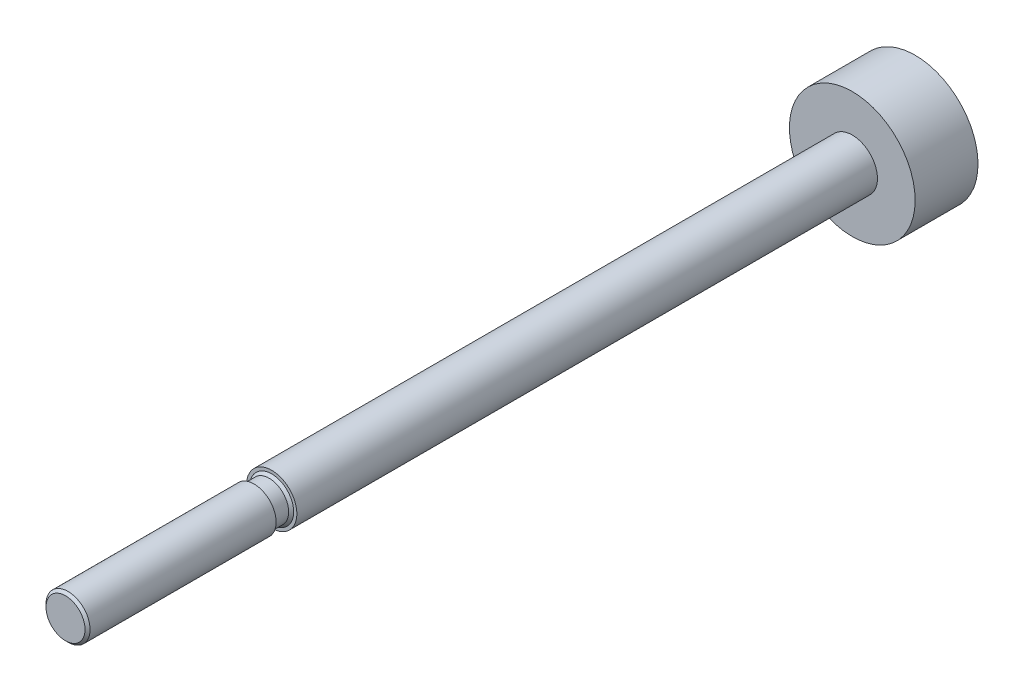
ISO-10303-21;
HEADER;
FILE_DESCRIPTION(('STEP AP214'),'2;1');
FILE_NAME('part.step','',(''),(''),'','','');
FILE_SCHEMA(('AUTOMOTIVE_DESIGN { 1 0 10303 214 1 1 1 1 }'));
ENDSEC;
DATA;
#1=APPLICATION_CONTEXT('core data for automotive mechanical design processes');
#2=APPLICATION_PROTOCOL_DEFINITION('international standard','automotive_design',2000,#1);
#3=PRODUCT_CONTEXT('',#1,'mechanical');
#4=PRODUCT('Part','Part','',(#3));
#5=PRODUCT_RELATED_PRODUCT_CATEGORY('part','',(#4));
#6=PRODUCT_DEFINITION_FORMATION('','',#4);
#7=PRODUCT_DEFINITION_CONTEXT('part definition',#1,'design');
#8=PRODUCT_DEFINITION('design','',#6,#7);
#9=PRODUCT_DEFINITION_SHAPE('','',#8);
#10=(LENGTH_UNIT() NAMED_UNIT(*) SI_UNIT(.MILLI.,.METRE.));
#11=(NAMED_UNIT(*) PLANE_ANGLE_UNIT() SI_UNIT($,.RADIAN.));
#12=(NAMED_UNIT(*) SI_UNIT($,.STERADIAN.) SOLID_ANGLE_UNIT());
#13=UNCERTAINTY_MEASURE_WITH_UNIT(LENGTH_MEASURE(1.E-05),#10,'distance_accuracy_value','');
#14=(GEOMETRIC_REPRESENTATION_CONTEXT(3) GLOBAL_UNCERTAINTY_ASSIGNED_CONTEXT((#13)) GLOBAL_UNIT_ASSIGNED_CONTEXT((#10,
#11,#12)) REPRESENTATION_CONTEXT('',''));
#15=CARTESIAN_POINT('',(0.,0.,0.));
#16=DIRECTION('',(0.,0.,1.));
#17=DIRECTION('',(1.,0.,0.));
#18=AXIS2_PLACEMENT_3D('',#15,#16,#17);
#19=CARTESIAN_POINT('',(0.,0.,2.5));
#20=DIRECTION('',(0.,0.,1.));
#21=DIRECTION('',(1.,0.,0.));
#22=AXIS2_PLACEMENT_3D('',#19,#20,#21);
#23=PLANE('',#22);
#24=CARTESIAN_POINT('',(0.,0.,2.5));
#25=DIRECTION('',(0.,0.,1.));
#26=DIRECTION('',(1.,0.,0.));
#27=AXIS2_PLACEMENT_3D('',#24,#25,#26);
#28=CIRCLE('',#27,5.);
#29=CARTESIAN_POINT('',(5.,0.,2.5));
#30=VERTEX_POINT('',#29);
#31=EDGE_CURVE('E40',#30,#30,#28,.T.);
#32=ORIENTED_EDGE('',*,*,#31,.T.);
#33=EDGE_LOOP('',(#32));
#34=FACE_BOUND('',#33,.T.);
#35=CARTESIAN_POINT('',(0.,0.,2.5));
#36=DIRECTION('',(0.,0.,1.));
#37=DIRECTION('',(1.,0.,0.));
#38=AXIS2_PLACEMENT_3D('',#35,#36,#37);
#39=CIRCLE('',#38,2.);
#40=CARTESIAN_POINT('',(2.,0.,2.5));
#41=VERTEX_POINT('',#40);
#42=EDGE_CURVE('E10',#41,#41,#39,.T.);
#43=ORIENTED_EDGE('',*,*,#42,.F.);
#44=EDGE_LOOP('',(#43));
#45=FACE_BOUND('',#44,.T.);
#46=ADVANCED_FACE('F32',(#34,#45),#23,.T.);
#47=CARTESIAN_POINT('',(0.,0.,2.5));
#48=DIRECTION('',(0.,0.,-1.));
#49=DIRECTION('',(-1.,0.,0.));
#50=AXIS2_PLACEMENT_3D('',#47,#48,#49);
#51=CYLINDRICAL_SURFACE('',#50,5.);
#52=ORIENTED_EDGE('',*,*,#31,.F.);
#53=EDGE_LOOP('',(#52));
#54=FACE_BOUND('',#53,.T.);
#55=CARTESIAN_POINT('',(0.,0.,-2.5));
#56=DIRECTION('',(0.,0.,1.));
#57=DIRECTION('',(1.,0.,0.));
#58=AXIS2_PLACEMENT_3D('',#55,#56,#57);
#59=CIRCLE('',#58,5.);
#60=CARTESIAN_POINT('',(5.,0.,-2.5));
#61=VERTEX_POINT('',#60);
#62=EDGE_CURVE('E44',#61,#61,#59,.T.);
#63=ORIENTED_EDGE('',*,*,#62,.T.);
#64=EDGE_LOOP('',(#63));
#65=FACE_BOUND('',#64,.T.);
#66=ADVANCED_FACE('F107',(#54,#65),#51,.T.);
#67=CARTESIAN_POINT('',(0.,0.,-2.5));
#68=DIRECTION('',(0.,0.,1.));
#69=DIRECTION('',(1.,0.,0.));
#70=AXIS2_PLACEMENT_3D('',#67,#68,#69);
#71=PLANE('',#70);
#72=ORIENTED_EDGE('',*,*,#62,.F.);
#73=EDGE_LOOP('',(#72));
#74=FACE_BOUND('',#73,.T.);
#75=ADVANCED_FACE('F113',(#74),#71,.F.);
#76=CARTESIAN_POINT('',(0.,0.,70.7418542494924));
#77=DIRECTION('',(0.,0.,-1.));
#78=DIRECTION('',(-1.,0.,0.));
#79=AXIS2_PLACEMENT_3D('',#76,#77,#78);
#80=CYLINDRICAL_SURFACE('',#79,2.);
#81=CARTESIAN_POINT('',(0.,0.,48.685));
#82=DIRECTION('',(0.,0.,-1.));
#83=DIRECTION('',(-1.,0.,0.));
#84=AXIS2_PLACEMENT_3D('',#81,#82,#83);
#85=CIRCLE('',#84,2.);
#86=CARTESIAN_POINT('',(-2.,0.,48.685));
#87=VERTEX_POINT('',#86);
#88=EDGE_CURVE('E36',#87,#87,#85,.T.);
#89=ORIENTED_EDGE('',*,*,#88,.T.);
#90=EDGE_LOOP('',(#89));
#91=FACE_BOUND('',#90,.T.);
#92=ORIENTED_EDGE('',*,*,#42,.T.);
#93=EDGE_LOOP('',(#92));
#94=FACE_BOUND('',#93,.T.);
#95=ADVANCED_FACE('F34',(#91,#94),#80,.T.);
#96=CARTESIAN_POINT('',(0.,1.75,48.685));
#97=DIRECTION('',(0.,0.,-1.));
#98=DIRECTION('',(-1.,0.,0.));
#99=AXIS2_PLACEMENT_3D('',#96,#97,#98);
#100=PLANE('',#99);
#101=CARTESIAN_POINT('',(0.,0.,48.685));
#102=DIRECTION('',(0.,0.,-1.));
#103=DIRECTION('',(-1.,0.,0.));
#104=AXIS2_PLACEMENT_3D('',#101,#102,#103);
#105=CIRCLE('',#104,1.75);
#106=CARTESIAN_POINT('',(-1.75,0.,48.685));
#107=VERTEX_POINT('',#106);
#108=EDGE_CURVE('E64',#107,#107,#105,.T.);
#109=ORIENTED_EDGE('',*,*,#108,.T.);
#110=EDGE_LOOP('',(#109));
#111=FACE_BOUND('',#110,.T.);
#112=ORIENTED_EDGE('',*,*,#88,.F.);
#113=EDGE_LOOP('',(#112));
#114=FACE_BOUND('',#113,.T.);
#115=ADVANCED_FACE('F68',(#111,#114),#100,.F.);
#116=CARTESIAN_POINT('',(0.,0.,65.085));
#117=DIRECTION('',(0.,0.,-1.));
#118=DIRECTION('',(-1.,0.,0.));
#119=AXIS2_PLACEMENT_3D('',#116,#117,#118);
#120=CONICAL_SURFACE('',#119,1.55249999999998,0.78539816339745);
#121=CARTESIAN_POINT('',(0.,0.,64.885));
#122=DIRECTION('',(0.,0.,-1.));
#123=DIRECTION('',(-1.,0.,0.));
#124=AXIS2_PLACEMENT_3D('',#121,#122,#123);
#125=CIRCLE('',#124,1.75249999999999);
#126=CARTESIAN_POINT('',(-1.75249999999999,0.,64.885));
#127=VERTEX_POINT('',#126);
#128=EDGE_CURVE('E52',#127,#127,#125,.T.);
#129=ORIENTED_EDGE('',*,*,#128,.F.);
#130=EDGE_LOOP('',(#129));
#131=FACE_BOUND('',#130,.T.);
#132=CARTESIAN_POINT('',(0.,0.,65.085));
#133=DIRECTION('',(0.,0.,-1.));
#134=DIRECTION('',(-1.,0.,0.));
#135=AXIS2_PLACEMENT_3D('',#132,#133,#134);
#136=CIRCLE('',#135,1.55249999999998);
#137=CARTESIAN_POINT('',(-1.55249999999998,0.,65.085));
#138=VERTEX_POINT('',#137);
#139=EDGE_CURVE('E49',#138,#138,#136,.T.);
#140=ORIENTED_EDGE('',*,*,#139,.T.);
#141=EDGE_LOOP('',(#140));
#142=FACE_BOUND('',#141,.T.);
#143=ADVANCED_FACE('F93',(#131,#142),#120,.T.);
#144=CARTESIAN_POINT('',(0.,0.,0.));
#145=DIRECTION('',(0.,0.,-1.));
#146=DIRECTION('',(-1.,0.,0.));
#147=AXIS2_PLACEMENT_3D('',#144,#145,#146);
#148=CYLINDRICAL_SURFACE('',#147,1.75249999999999);
#149=CARTESIAN_POINT('',(0.,0.,50.085));
#150=DIRECTION('',(0.,0.,-1.));
#151=DIRECTION('',(-1.,0.,0.));
#152=AXIS2_PLACEMENT_3D('',#149,#150,#151);
#153=CIRCLE('',#152,1.75249999999999);
#154=CARTESIAN_POINT('',(-1.75249999999999,0.,50.085));
#155=VERTEX_POINT('',#154);
#156=EDGE_CURVE('E55',#155,#155,#153,.T.);
#157=ORIENTED_EDGE('',*,*,#156,.F.);
#158=EDGE_LOOP('',(#157));
#159=FACE_BOUND('',#158,.T.);
#160=ORIENTED_EDGE('',*,*,#128,.T.);
#161=EDGE_LOOP('',(#160));
#162=FACE_BOUND('',#161,.T.);
#163=ADVANCED_FACE('F87',(#159,#162),#148,.T.);
#164=CARTESIAN_POINT('',(0.,1.75249999999999,50.085));
#165=DIRECTION('',(0.,0.,1.));
#166=DIRECTION('',(1.,0.,0.));
#167=AXIS2_PLACEMENT_3D('',#164,#165,#166);
#168=PLANE('',#167);
#169=CARTESIAN_POINT('',(0.,0.,50.085));
#170=DIRECTION('',(0.,0.,-1.));
#171=DIRECTION('',(-1.,0.,0.));
#172=AXIS2_PLACEMENT_3D('',#169,#170,#171);
#173=CIRCLE('',#172,1.54999999999999);
#174=CARTESIAN_POINT('',(-1.54999999999999,0.,50.085));
#175=VERTEX_POINT('',#174);
#176=EDGE_CURVE('E58',#175,#175,#173,.T.);
#177=ORIENTED_EDGE('',*,*,#176,.F.);
#178=EDGE_LOOP('',(#177));
#179=FACE_BOUND('',#178,.T.);
#180=ORIENTED_EDGE('',*,*,#156,.T.);
#181=EDGE_LOOP('',(#180));
#182=FACE_BOUND('',#181,.T.);
#183=ADVANCED_FACE('F81',(#179,#182),#168,.F.);
#184=CARTESIAN_POINT('',(0.,0.,0.));
#185=DIRECTION('',(0.,0.,-1.));
#186=DIRECTION('',(-1.,0.,0.));
#187=AXIS2_PLACEMENT_3D('',#184,#185,#186);
#188=CYLINDRICAL_SURFACE('',#187,1.54999999999999);
#189=CARTESIAN_POINT('',(0.,0.,48.885));
#190=DIRECTION('',(0.,0.,-1.));
#191=DIRECTION('',(-1.,0.,0.));
#192=AXIS2_PLACEMENT_3D('',#189,#190,#191);
#193=CIRCLE('',#192,1.54999999999999);
#194=CARTESIAN_POINT('',(-1.54999999999999,0.,48.885));
#195=VERTEX_POINT('',#194);
#196=EDGE_CURVE('E61',#195,#195,#193,.T.);
#197=ORIENTED_EDGE('',*,*,#196,.F.);
#198=EDGE_LOOP('',(#197));
#199=FACE_BOUND('',#198,.T.);
#200=ORIENTED_EDGE('',*,*,#176,.T.);
#201=EDGE_LOOP('',(#200));
#202=FACE_BOUND('',#201,.T.);
#203=ADVANCED_FACE('F75',(#199,#202),#188,.T.);
#204=CARTESIAN_POINT('',(0.,0.,48.885));
#205=DIRECTION('',(0.,0.,-1.));
#206=DIRECTION('',(-1.,0.,0.));
#207=AXIS2_PLACEMENT_3D('',#204,#205,#206);
#208=CONICAL_SURFACE('',#207,1.54999999999999,0.785398163397452);
#209=ORIENTED_EDGE('',*,*,#108,.F.);
#210=EDGE_LOOP('',(#209));
#211=FACE_BOUND('',#210,.T.);
#212=ORIENTED_EDGE('',*,*,#196,.T.);
#213=EDGE_LOOP('',(#212));
#214=FACE_BOUND('',#213,.T.);
#215=ADVANCED_FACE('F71',(#211,#214),#208,.T.);
#216=CARTESIAN_POINT('',(0.,0.,65.085));
#217=DIRECTION('',(0.,0.,-1.));
#218=DIRECTION('',(-1.,0.,0.));
#219=AXIS2_PLACEMENT_3D('',#216,#217,#218);
#220=PLANE('',#219);
#221=ORIENTED_EDGE('',*,*,#139,.F.);
#222=EDGE_LOOP('',(#221));
#223=FACE_BOUND('',#222,.T.);
#224=ADVANCED_FACE('F74',(#223),#220,.F.);
#225=CLOSED_SHELL('',(#46,#66,#75,#95,#115,#143,#163,#183,#203,#215,#224));
#226=MANIFOLD_SOLID_BREP('B2',#225);
#227=ADVANCED_BREP_SHAPE_REPRESENTATION('',(#18,#226),#14);
#228=SHAPE_DEFINITION_REPRESENTATION(#9,#227);
ENDSEC;
END-ISO-10303-21;
